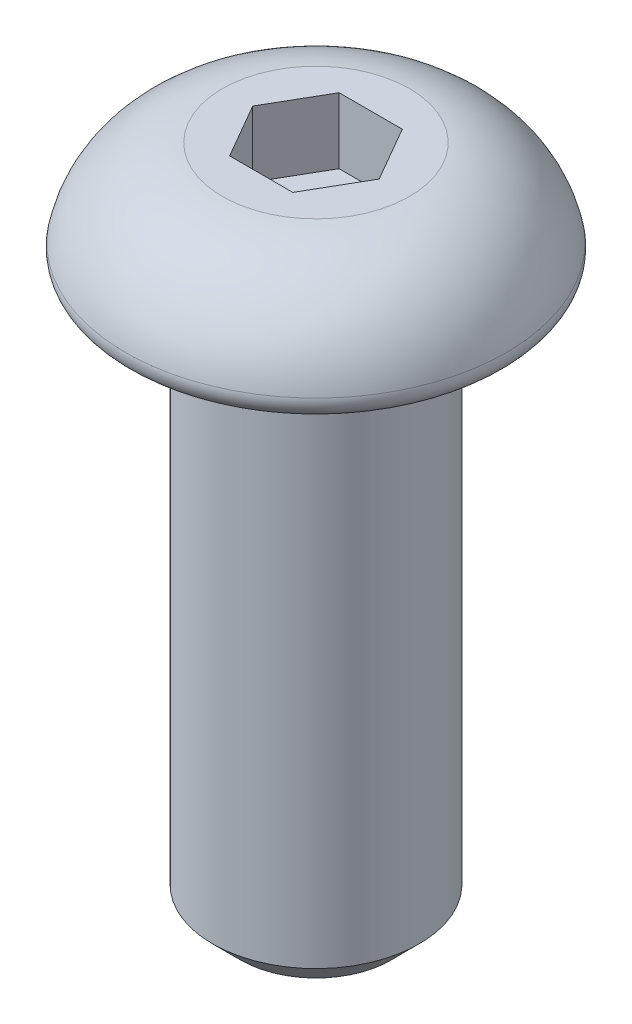
ISO-10303-21;
HEADER;
FILE_DESCRIPTION(('STEP AP214'),'2;1');
FILE_NAME('part.step','',(''),(''),'','','');
FILE_SCHEMA(('AUTOMOTIVE_DESIGN { 1 0 10303 214 1 1 1 1 }'));
ENDSEC;
DATA;
#1=APPLICATION_CONTEXT('core data for automotive mechanical design processes');
#2=APPLICATION_PROTOCOL_DEFINITION('international standard','automotive_design',2000,#1);
#3=PRODUCT_CONTEXT('',#1,'mechanical');
#4=PRODUCT('Part','Part','',(#3));
#5=PRODUCT_RELATED_PRODUCT_CATEGORY('part','',(#4));
#6=PRODUCT_DEFINITION_FORMATION('','',#4);
#7=PRODUCT_DEFINITION_CONTEXT('part definition',#1,'design');
#8=PRODUCT_DEFINITION('design','',#6,#7);
#9=PRODUCT_DEFINITION_SHAPE('','',#8);
#10=(LENGTH_UNIT() NAMED_UNIT(*) SI_UNIT(.MILLI.,.METRE.));
#11=(NAMED_UNIT(*) PLANE_ANGLE_UNIT() SI_UNIT($,.RADIAN.));
#12=(NAMED_UNIT(*) SI_UNIT($,.STERADIAN.) SOLID_ANGLE_UNIT());
#13=UNCERTAINTY_MEASURE_WITH_UNIT(LENGTH_MEASURE(1.E-05),#10,'distance_accuracy_value','');
#14=(GEOMETRIC_REPRESENTATION_CONTEXT(3) GLOBAL_UNCERTAINTY_ASSIGNED_CONTEXT((#13)) GLOBAL_UNIT_ASSIGNED_CONTEXT((#10,
#11,#12)) REPRESENTATION_CONTEXT('',''));
#15=CARTESIAN_POINT('',(0.,0.,0.));
#16=DIRECTION('',(0.,0.,1.));
#17=DIRECTION('',(1.,0.,0.));
#18=AXIS2_PLACEMENT_3D('',#15,#16,#17);
#19=CARTESIAN_POINT('',(0.,0.7366,0.));
#20=DIRECTION('',(0.,1.,0.));
#21=DIRECTION('',(-1.,0.,0.));
#22=AXIS2_PLACEMENT_3D('',#19,#20,#21);
#23=PLANE('',#22);
#24=DIRECTION('',(-0.5,0.,0.866025403784439));
#25=VECTOR('',#24,1.);
#26=CARTESIAN_POINT('',(-0.536575,0.7366,-0.92937516207127));
#27=LINE('',#26,#25);
#28=CARTESIAN_POINT('',(-0.536575,0.7366,-0.92937516207127));
#29=VERTEX_POINT('',#28);
#30=CARTESIAN_POINT('',(-1.07315,0.7366,0.));
#31=VERTEX_POINT('',#30);
#32=EDGE_CURVE('E142',#29,#31,#27,.T.);
#33=ORIENTED_EDGE('',*,*,#32,.T.);
#34=DIRECTION('',(0.5,0.,0.866025403784439));
#35=VECTOR('',#34,1.);
#36=CARTESIAN_POINT('',(-1.07315,0.7366,0.));
#37=LINE('',#36,#35);
#38=CARTESIAN_POINT('',(-0.536575,0.7366,0.92937516207127));
#39=VERTEX_POINT('',#38);
#40=EDGE_CURVE('E137',#31,#39,#37,.T.);
#41=ORIENTED_EDGE('',*,*,#40,.T.);
#42=DIRECTION('',(1.,0.,0.));
#43=VECTOR('',#42,1.);
#44=CARTESIAN_POINT('',(-0.536575,0.7366,0.92937516207127));
#45=LINE('',#44,#43);
#46=CARTESIAN_POINT('',(0.536575,0.7366,0.92937516207127));
#47=VERTEX_POINT('',#46);
#48=EDGE_CURVE('E76',#39,#47,#45,.T.);
#49=ORIENTED_EDGE('',*,*,#48,.T.);
#50=DIRECTION('',(0.5,0.,-0.866025403784439));
#51=VECTOR('',#50,1.);
#52=CARTESIAN_POINT('',(0.536575,0.7366,0.92937516207127));
#53=LINE('',#52,#51);
#54=CARTESIAN_POINT('',(1.07315,0.7366,0.));
#55=VERTEX_POINT('',#54);
#56=EDGE_CURVE('E73',#47,#55,#53,.T.);
#57=ORIENTED_EDGE('',*,*,#56,.T.);
#58=DIRECTION('',(-0.5,0.,-0.866025403784439));
#59=VECTOR('',#58,1.);
#60=CARTESIAN_POINT('',(1.07315,0.7366,0.));
#61=LINE('',#60,#59);
#62=CARTESIAN_POINT('',(0.536575,0.7366,-0.92937516207127));
#63=VERTEX_POINT('',#62);
#64=EDGE_CURVE('E70',#55,#63,#61,.T.);
#65=ORIENTED_EDGE('',*,*,#64,.T.);
#66=DIRECTION('',(-1.,0.,0.));
#67=VECTOR('',#66,1.);
#68=CARTESIAN_POINT('',(0.536575,0.7366,-0.92937516207127));
#69=LINE('',#68,#67);
#70=EDGE_CURVE('E93',#63,#29,#69,.T.);
#71=ORIENTED_EDGE('',*,*,#70,.T.);
#72=EDGE_LOOP('',(#33,#41,#49,#57,#65,#71));
#73=FACE_BOUND('',#72,.T.);
#74=ADVANCED_FACE('F18',(#73),#23,.T.);
#75=CARTESIAN_POINT('',(0.536575,1.8542,0.92937516207127));
#76=DIRECTION('',(0.866025403784439,0.,0.5));
#77=DIRECTION('',(0.5,0.,-0.866025403784439));
#78=AXIS2_PLACEMENT_3D('',#75,#76,#77);
#79=PLANE('',#78);
#80=DIRECTION('',(0.,1.,0.));
#81=VECTOR('',#80,1.);
#82=CARTESIAN_POINT('',(1.07315,1.8542,0.));
#83=LINE('',#82,#81);
#84=CARTESIAN_POINT('',(1.07315,1.8542,0.));
#85=VERTEX_POINT('',#84);
#86=EDGE_CURVE('E79',#85,#55,#83,.F.);
#87=ORIENTED_EDGE('',*,*,#86,.T.);
#88=ORIENTED_EDGE('',*,*,#56,.F.);
#89=DIRECTION('',(0.,1.,0.));
#90=VECTOR('',#89,1.);
#91=CARTESIAN_POINT('',(0.536575,1.8542,0.92937516207127));
#92=LINE('',#91,#90);
#93=CARTESIAN_POINT('',(0.536575,1.8542,0.92937516207127));
#94=VERTEX_POINT('',#93);
#95=EDGE_CURVE('E132',#47,#94,#92,.T.);
#96=ORIENTED_EDGE('',*,*,#95,.T.);
#97=DIRECTION('',(0.5,0.,-0.866025403784439));
#98=VECTOR('',#97,1.);
#99=CARTESIAN_POINT('',(0.536575,1.8542,0.92937516207127));
#100=LINE('',#99,#98);
#101=EDGE_CURVE('E84',#94,#85,#100,.T.);
#102=ORIENTED_EDGE('',*,*,#101,.T.);
#103=EDGE_LOOP('',(#87,#88,#96,#102));
#104=FACE_BOUND('',#103,.T.);
#105=ADVANCED_FACE('F82',(#104),#79,.F.);
#106=CARTESIAN_POINT('',(1.07315,1.8542,0.));
#107=DIRECTION('',(0.866025403784439,0.,-0.5));
#108=DIRECTION('',(-0.5,0.,-0.866025403784439));
#109=AXIS2_PLACEMENT_3D('',#106,#107,#108);
#110=PLANE('',#109);
#111=DIRECTION('',(0.,1.,0.));
#112=VECTOR('',#111,1.);
#113=CARTESIAN_POINT('',(0.536575000000001,1.8542,-0.92937516207127));
#114=LINE('',#113,#112);
#115=CARTESIAN_POINT('',(0.536575,1.8542,-0.92937516207127));
#116=VERTEX_POINT('',#115);
#117=EDGE_CURVE('E90',#116,#63,#114,.F.);
#118=ORIENTED_EDGE('',*,*,#117,.T.);
#119=ORIENTED_EDGE('',*,*,#64,.F.);
#120=ORIENTED_EDGE('',*,*,#86,.F.);
#121=DIRECTION('',(-0.499999999999999,0.,-0.866025403784439));
#122=VECTOR('',#121,1.);
#123=CARTESIAN_POINT('',(1.07315,1.8542,0.));
#124=LINE('',#123,#122);
#125=EDGE_CURVE('E129',#85,#116,#124,.T.);
#126=ORIENTED_EDGE('',*,*,#125,.T.);
#127=EDGE_LOOP('',(#118,#119,#120,#126));
#128=FACE_BOUND('',#127,.T.);
#129=ADVANCED_FACE('F88',(#128),#110,.F.);
#130=CARTESIAN_POINT('',(0.536575,1.8542,-0.92937516207127));
#131=DIRECTION('',(0.,0.,-1.));
#132=DIRECTION('',(-1.,0.,0.));
#133=AXIS2_PLACEMENT_3D('',#130,#131,#132);
#134=PLANE('',#133);
#135=DIRECTION('',(0.,1.,0.));
#136=VECTOR('',#135,1.);
#137=CARTESIAN_POINT('',(-0.536575,1.8542,-0.92937516207127));
#138=LINE('',#137,#136);
#139=CARTESIAN_POINT('',(-0.536575,1.8542,-0.92937516207127));
#140=VERTEX_POINT('',#139);
#141=EDGE_CURVE('E144',#140,#29,#138,.F.);
#142=ORIENTED_EDGE('',*,*,#141,.T.);
#143=ORIENTED_EDGE('',*,*,#70,.F.);
#144=ORIENTED_EDGE('',*,*,#117,.F.);
#145=DIRECTION('',(1.,0.,0.));
#146=VECTOR('',#145,1.);
#147=CARTESIAN_POINT('',(0.,1.8542,-0.92937516207127));
#148=LINE('',#147,#146);
#149=EDGE_CURVE('E127',#116,#140,#148,.F.);
#150=ORIENTED_EDGE('',*,*,#149,.T.);
#151=EDGE_LOOP('',(#142,#143,#144,#150));
#152=FACE_BOUND('',#151,.T.);
#153=ADVANCED_FACE('F149',(#152),#134,.F.);
#154=CARTESIAN_POINT('',(-0.536575,1.8542,-0.92937516207127));
#155=DIRECTION('',(-0.866025403784439,0.,-0.5));
#156=DIRECTION('',(-0.5,0.,0.866025403784439));
#157=AXIS2_PLACEMENT_3D('',#154,#155,#156);
#158=PLANE('',#157);
#159=DIRECTION('',(0.,1.,0.));
#160=VECTOR('',#159,1.);
#161=CARTESIAN_POINT('',(-1.07315,1.8542,0.));
#162=LINE('',#161,#160);
#163=CARTESIAN_POINT('',(-1.07315,1.8542,0.));
#164=VERTEX_POINT('',#163);
#165=EDGE_CURVE('E139',#164,#31,#162,.F.);
#166=ORIENTED_EDGE('',*,*,#165,.T.);
#167=ORIENTED_EDGE('',*,*,#32,.F.);
#168=ORIENTED_EDGE('',*,*,#141,.F.);
#169=DIRECTION('',(-0.5,0.,0.866025403784438));
#170=VECTOR('',#169,1.);
#171=CARTESIAN_POINT('',(-0.536575,1.8542,-0.92937516207127));
#172=LINE('',#171,#170);
#173=EDGE_CURVE('E125',#140,#164,#172,.T.);
#174=ORIENTED_EDGE('',*,*,#173,.T.);
#175=EDGE_LOOP('',(#166,#167,#168,#174));
#176=FACE_BOUND('',#175,.T.);
#177=ADVANCED_FACE('F153',(#176),#158,.F.);
#178=CARTESIAN_POINT('',(-1.07315,1.8542,0.));
#179=DIRECTION('',(-0.866025403784439,0.,0.5));
#180=DIRECTION('',(0.5,0.,0.866025403784439));
#181=AXIS2_PLACEMENT_3D('',#178,#179,#180);
#182=PLANE('',#181);
#183=DIRECTION('',(0.,1.,0.));
#184=VECTOR('',#183,1.);
#185=CARTESIAN_POINT('',(-0.536575,1.8542,0.92937516207127));
#186=LINE('',#185,#184);
#187=CARTESIAN_POINT('',(-0.536575,1.8542,0.92937516207127));
#188=VERTEX_POINT('',#187);
#189=EDGE_CURVE('E135',#188,#39,#186,.F.);
#190=ORIENTED_EDGE('',*,*,#189,.T.);
#191=ORIENTED_EDGE('',*,*,#40,.F.);
#192=ORIENTED_EDGE('',*,*,#165,.F.);
#193=DIRECTION('',(0.5,0.,0.866025403784439));
#194=VECTOR('',#193,1.);
#195=CARTESIAN_POINT('',(-1.07315,1.8542,0.));
#196=LINE('',#195,#194);
#197=EDGE_CURVE('E37',#164,#188,#196,.T.);
#198=ORIENTED_EDGE('',*,*,#197,.T.);
#199=EDGE_LOOP('',(#190,#191,#192,#198));
#200=FACE_BOUND('',#199,.T.);
#201=ADVANCED_FACE('F155',(#200),#182,.F.);
#202=CARTESIAN_POINT('',(-0.536575,1.8542,0.92937516207127));
#203=DIRECTION('',(0.,0.,1.));
#204=DIRECTION('',(1.,0.,0.));
#205=AXIS2_PLACEMENT_3D('',#202,#203,#204);
#206=PLANE('',#205);
#207=ORIENTED_EDGE('',*,*,#95,.F.);
#208=ORIENTED_EDGE('',*,*,#48,.F.);
#209=ORIENTED_EDGE('',*,*,#189,.F.);
#210=DIRECTION('',(1.,0.,0.));
#211=VECTOR('',#210,1.);
#212=CARTESIAN_POINT('',(0.,1.8542,0.92937516207127));
#213=LINE('',#212,#211);
#214=EDGE_CURVE('E113',#188,#94,#213,.T.);
#215=ORIENTED_EDGE('',*,*,#214,.T.);
#216=EDGE_LOOP('',(#207,#208,#209,#215));
#217=FACE_BOUND('',#216,.T.);
#218=ADVANCED_FACE('F158',(#217),#206,.F.);
#219=CARTESIAN_POINT('',(0.,1.8542,0.));
#220=DIRECTION('',(0.,-1.,0.));
#221=DIRECTION('',(1.,0.,0.));
#222=AXIS2_PLACEMENT_3D('',#219,#220,#221);
#223=PLANE('',#222);
#224=ORIENTED_EDGE('',*,*,#197,.F.);
#225=ORIENTED_EDGE('',*,*,#173,.F.);
#226=ORIENTED_EDGE('',*,*,#149,.F.);
#227=ORIENTED_EDGE('',*,*,#125,.F.);
#228=ORIENTED_EDGE('',*,*,#101,.F.);
#229=ORIENTED_EDGE('',*,*,#214,.F.);
#230=EDGE_LOOP('',(#224,#225,#226,#227,#228,#229));
#231=FACE_BOUND('',#230,.T.);
#232=CARTESIAN_POINT('',(0.,1.8542,0.));
#233=DIRECTION('',(0.,-1.,0.));
#234=DIRECTION('',(0.,0.,-1.));
#235=AXIS2_PLACEMENT_3D('',#232,#233,#234);
#236=CIRCLE('',#235,1.5875);
#237=CARTESIAN_POINT('',(0.,1.8542,-1.5875));
#238=VERTEX_POINT('',#237);
#239=EDGE_CURVE('E22',#238,#238,#236,.F.);
#240=ORIENTED_EDGE('',*,*,#239,.T.);
#241=EDGE_LOOP('',(#240));
#242=FACE_BOUND('',#241,.T.);
#243=ADVANCED_FACE('F160',(#231,#242),#223,.F.);
#244=CARTESIAN_POINT('',(0.,0.,0.));
#245=DIRECTION('',(0.,-1.,0.));
#246=DIRECTION('',(0.,0.,-1.));
#247=AXIS2_PLACEMENT_3D('',#244,#245,#246);
#248=DEGENERATE_TOROIDAL_SURFACE('',#247,1.40765892857135,1.86290108459162,.T.);
#249=ORIENTED_EDGE('',*,*,#239,.F.);
#250=EDGE_LOOP('',(#249));
#251=FACE_BOUND('',#250,.T.);
#252=CARTESIAN_POINT('',(0.,0.381,0.));
#253=DIRECTION('',(0.,-1.,0.));
#254=DIRECTION('',(0.,0.,-1.));
#255=AXIS2_PLACEMENT_3D('',#252,#253,#254);
#256=CIRCLE('',#255,3.23118283874435);
#257=CARTESIAN_POINT('',(0.,0.381,-3.23118283874435));
#258=VERTEX_POINT('',#257);
#259=EDGE_CURVE('E104',#258,#258,#256,.T.);
#260=ORIENTED_EDGE('',*,*,#259,.F.);
#261=EDGE_LOOP('',(#260));
#262=FACE_BOUND('',#261,.T.);
#263=ADVANCED_FACE('F20',(#251,#262),#248,.T.);
#264=CARTESIAN_POINT('',(0.,0.316308645734525,0.));
#265=DIRECTION('',(0.,-1.,0.));
#266=DIRECTION('',(0.,0.,-1.));
#267=AXIS2_PLACEMENT_3D('',#264,#265,#266);
#268=TOROIDAL_SURFACE('',#267,2.92156018445415,0.316308645734525);
#269=CARTESIAN_POINT('',(0.,0.,0.));
#270=DIRECTION('',(0.,1.,0.));
#271=DIRECTION('',(-1.,0.,0.));
#272=AXIS2_PLACEMENT_3D('',#269,#270,#271);
#273=CIRCLE('',#272,2.92156018445415);
#274=CARTESIAN_POINT('',(-2.92156018445415,0.,0.));
#275=VERTEX_POINT('',#274);
#276=EDGE_CURVE('E99',#275,#275,#273,.F.);
#277=ORIENTED_EDGE('',*,*,#276,.F.);
#278=EDGE_LOOP('',(#277));
#279=FACE_BOUND('',#278,.T.);
#280=ORIENTED_EDGE('',*,*,#259,.T.);
#281=EDGE_LOOP('',(#280));
#282=FACE_BOUND('',#281,.T.);
#283=ADVANCED_FACE('F168',(#279,#282),#268,.T.);
#284=CARTESIAN_POINT('',(0.,-9.525,0.));
#285=DIRECTION('',(0.,1.,0.));
#286=DIRECTION('',(0.,0.,1.));
#287=AXIS2_PLACEMENT_3D('',#284,#285,#286);
#288=PLANE('',#287);
#289=CARTESIAN_POINT('',(0.,-9.52499999993961,0.));
#290=DIRECTION('',(0.,1.,0.));
#291=DIRECTION('',(0.,0.,1.));
#292=AXIS2_PLACEMENT_3D('',#289,#290,#291);
#293=CIRCLE('',#292,1.28016000002162);
#294=CARTESIAN_POINT('',(0.,-9.52499999993961,1.28016000002162));
#295=VERTEX_POINT('',#294);
#296=EDGE_CURVE('E96',#295,#295,#293,.T.);
#297=ORIENTED_EDGE('',*,*,#296,.F.);
#298=EDGE_LOOP('',(#297));
#299=FACE_BOUND('',#298,.T.);
#300=ADVANCED_FACE('F173',(#299),#288,.F.);
#301=CARTESIAN_POINT('',(0.,0.,0.));
#302=DIRECTION('',(0.,-1.,0.));
#303=DIRECTION('',(1.,0.,0.));
#304=AXIS2_PLACEMENT_3D('',#301,#302,#303);
#305=PLANE('',#304);
#306=CARTESIAN_POINT('',(0.,0.,0.));
#307=DIRECTION('',(0.,-1.,0.));
#308=DIRECTION('',(-1.,0.,0.));
#309=AXIS2_PLACEMENT_3D('',#306,#307,#308);
#310=CIRCLE('',#309,2.0066);
#311=CARTESIAN_POINT('',(-2.0066,0.,1.48846298931994E-13));
#312=VERTEX_POINT('',#311);
#313=EDGE_CURVE('E98',#312,#312,#310,.F.);
#314=ORIENTED_EDGE('',*,*,#313,.T.);
#315=EDGE_LOOP('',(#314));
#316=FACE_BOUND('',#315,.T.);
#317=ORIENTED_EDGE('',*,*,#276,.T.);
#318=EDGE_LOOP('',(#317));
#319=FACE_BOUND('',#318,.T.);
#320=ADVANCED_FACE('F201',(#316,#319),#305,.T.);
#321=CARTESIAN_POINT('',(0.,-9.05256000010013,0.));
#322=DIRECTION('',(0.,1.,0.));
#323=DIRECTION('',(0.,0.,1.));
#324=AXIS2_PLACEMENT_3D('',#321,#322,#323);
#325=CONICAL_SURFACE('',#324,1.75259999980426,0.785398163337289);
#326=CARTESIAN_POINT('',(0.,-9.05256,0.));
#327=DIRECTION('',(0.,1.,0.));
#328=DIRECTION('',(0.,0.,1.));
#329=AXIS2_PLACEMENT_3D('',#326,#327,#328);
#330=CIRCLE('',#329,1.7526);
#331=CARTESIAN_POINT('',(0.,-9.05256,1.7526));
#332=VERTEX_POINT('',#331);
#333=EDGE_CURVE('E28',#332,#332,#330,.T.);
#334=ORIENTED_EDGE('',*,*,#333,.F.);
#335=EDGE_LOOP('',(#334));
#336=FACE_BOUND('',#335,.T.);
#337=ORIENTED_EDGE('',*,*,#296,.T.);
#338=EDGE_LOOP('',(#337));
#339=FACE_BOUND('',#338,.T.);
#340=ADVANCED_FACE('F183',(#336,#339),#325,.T.);
#341=CARTESIAN_POINT('',(0.,-0.254,0.));
#342=DIRECTION('',(0.,1.,0.));
#343=DIRECTION('',(0.,0.,1.));
#344=AXIS2_PLACEMENT_3D('',#341,#342,#343);
#345=TOROIDAL_SURFACE('',#344,2.0066,0.254);
#346=ORIENTED_EDGE('',*,*,#313,.F.);
#347=EDGE_LOOP('',(#346));
#348=FACE_BOUND('',#347,.T.);
#349=CARTESIAN_POINT('',(0.,-0.254,0.));
#350=DIRECTION('',(0.,1.,0.));
#351=DIRECTION('',(0.,0.,1.));
#352=AXIS2_PLACEMENT_3D('',#349,#350,#351);
#353=CIRCLE('',#352,1.7526);
#354=CARTESIAN_POINT('',(0.,-0.254,1.7526));
#355=VERTEX_POINT('',#354);
#356=EDGE_CURVE('E11',#355,#355,#353,.F.);
#357=ORIENTED_EDGE('',*,*,#356,.F.);
#358=EDGE_LOOP('',(#357));
#359=FACE_BOUND('',#358,.T.);
#360=ADVANCED_FACE('F177',(#348,#359),#345,.F.);
#361=CARTESIAN_POINT('',(0.,0.,0.));
#362=DIRECTION('',(0.,1.,0.));
#363=DIRECTION('',(0.,0.,1.));
#364=AXIS2_PLACEMENT_3D('',#361,#362,#363);
#365=CYLINDRICAL_SURFACE('',#364,1.7526);
#366=ORIENTED_EDGE('',*,*,#356,.T.);
#367=EDGE_LOOP('',(#366));
#368=FACE_BOUND('',#367,.T.);
#369=ORIENTED_EDGE('',*,*,#333,.T.);
#370=EDGE_LOOP('',(#369));
#371=FACE_BOUND('',#370,.T.);
#372=ADVANCED_FACE('F175',(#368,#371),#365,.T.);
#373=CLOSED_SHELL('',(#74,#105,#129,#153,#177,#201,#218,#243,#263,#283,#300,#320,#340,#360,#372));
#374=MANIFOLD_SOLID_BREP('B1',#373);
#375=ADVANCED_BREP_SHAPE_REPRESENTATION('',(#18,#374),#14);
#376=SHAPE_DEFINITION_REPRESENTATION(#9,#375);
ENDSEC;
END-ISO-10303-21;
